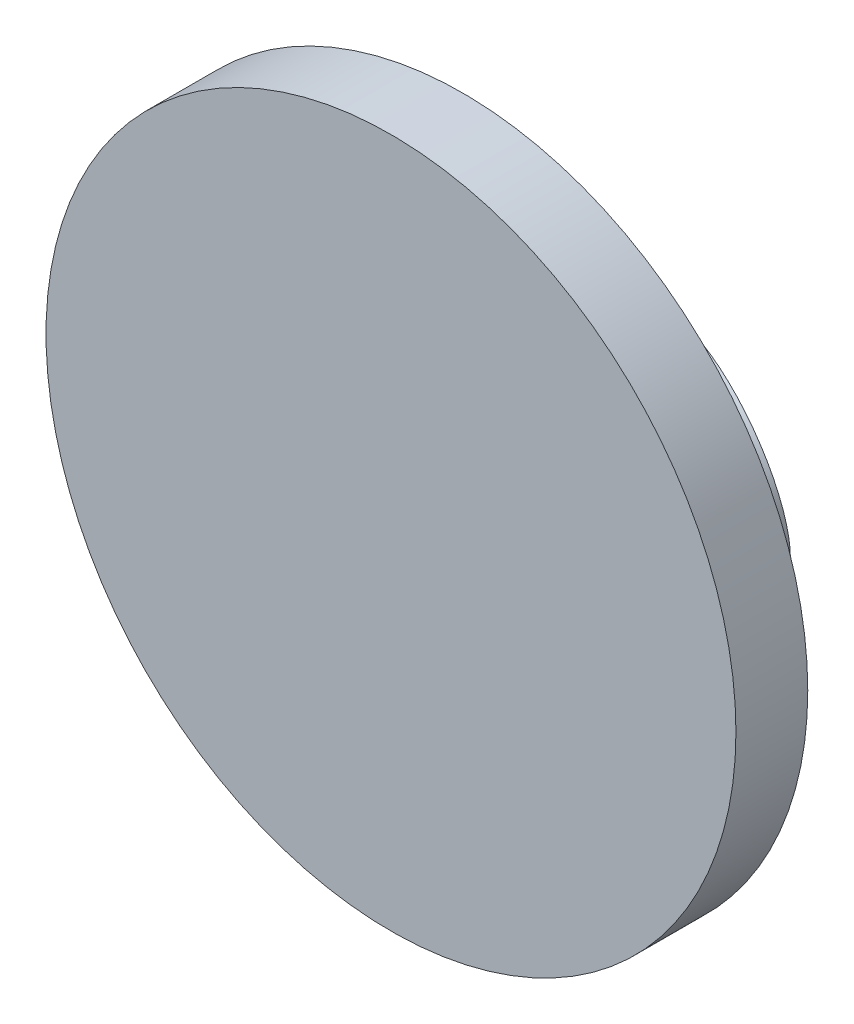
ISO-10303-21;
HEADER;
FILE_DESCRIPTION(('STEP AP214'),'2;1');
FILE_NAME('part.step','',(''),(''),'','','');
FILE_SCHEMA(('AUTOMOTIVE_DESIGN { 1 0 10303 214 1 1 1 1 }'));
ENDSEC;
DATA;
#1=APPLICATION_CONTEXT('core data for automotive mechanical design processes');
#2=APPLICATION_PROTOCOL_DEFINITION('international standard','automotive_design',2000,#1);
#3=PRODUCT_CONTEXT('',#1,'mechanical');
#4=PRODUCT('Part','Part','',(#3));
#5=PRODUCT_RELATED_PRODUCT_CATEGORY('part','',(#4));
#6=PRODUCT_DEFINITION_FORMATION('','',#4);
#7=PRODUCT_DEFINITION_CONTEXT('part definition',#1,'design');
#8=PRODUCT_DEFINITION('design','',#6,#7);
#9=PRODUCT_DEFINITION_SHAPE('','',#8);
#10=(LENGTH_UNIT() NAMED_UNIT(*) SI_UNIT(.MILLI.,.METRE.));
#11=(NAMED_UNIT(*) PLANE_ANGLE_UNIT() SI_UNIT($,.RADIAN.));
#12=(NAMED_UNIT(*) SI_UNIT($,.STERADIAN.) SOLID_ANGLE_UNIT());
#13=UNCERTAINTY_MEASURE_WITH_UNIT(LENGTH_MEASURE(1.E-05),#10,'distance_accuracy_value','');
#14=(GEOMETRIC_REPRESENTATION_CONTEXT(3) GLOBAL_UNCERTAINTY_ASSIGNED_CONTEXT((#13)) GLOBAL_UNIT_ASSIGNED_CONTEXT((#10,
#11,#12)) REPRESENTATION_CONTEXT('',''));
#15=CARTESIAN_POINT('',(0.,0.,0.));
#16=DIRECTION('',(0.,0.,1.));
#17=DIRECTION('',(1.,0.,0.));
#18=AXIS2_PLACEMENT_3D('',#15,#16,#17);
#19=CARTESIAN_POINT('',(0.,0.,8.85));
#20=DIRECTION('',(0.,0.,-1.));
#21=DIRECTION('',(-1.,0.,0.));
#22=AXIS2_PLACEMENT_3D('',#19,#20,#21);
#23=CYLINDRICAL_SURFACE('',#22,42.5);
#24=CARTESIAN_POINT('',(0.,0.,8.85));
#25=DIRECTION('',(0.,0.,1.));
#26=DIRECTION('',(1.,0.,0.));
#27=AXIS2_PLACEMENT_3D('',#24,#25,#26);
#28=CIRCLE('',#27,42.5);
#29=CARTESIAN_POINT('',(42.5,0.,8.85));
#30=VERTEX_POINT('',#29);
#31=EDGE_CURVE('E94',#30,#30,#28,.T.);
#32=ORIENTED_EDGE('',*,*,#31,.F.);
#33=EDGE_LOOP('',(#32));
#34=FACE_BOUND('',#33,.T.);
#35=CARTESIAN_POINT('',(0.,0.,0.));
#36=DIRECTION('',(0.,0.,1.));
#37=DIRECTION('',(1.,0.,0.));
#38=AXIS2_PLACEMENT_3D('',#35,#36,#37);
#39=CIRCLE('',#38,42.5);
#40=CARTESIAN_POINT('',(42.5,0.,0.));
#41=VERTEX_POINT('',#40);
#42=EDGE_CURVE('E92',#41,#41,#39,.T.);
#43=ORIENTED_EDGE('',*,*,#42,.T.);
#44=EDGE_LOOP('',(#43));
#45=FACE_BOUND('',#44,.T.);
#46=ADVANCED_FACE('F38',(#34,#45),#23,.T.);
#47=CARTESIAN_POINT('',(0.,0.,8.85));
#48=DIRECTION('',(0.,0.,1.));
#49=DIRECTION('',(1.,0.,0.));
#50=AXIS2_PLACEMENT_3D('',#47,#48,#49);
#51=PLANE('',#50);
#52=ORIENTED_EDGE('',*,*,#31,.T.);
#53=EDGE_LOOP('',(#52));
#54=FACE_BOUND('',#53,.T.);
#55=ADVANCED_FACE('F81',(#54),#51,.T.);
#56=CARTESIAN_POINT('',(0.,0.,0.));
#57=DIRECTION('',(0.,0.,1.));
#58=DIRECTION('',(1.,0.,0.));
#59=AXIS2_PLACEMENT_3D('',#56,#57,#58);
#60=PLANE('',#59);
#61=DIRECTION('',(0.499999999999998,-0.86602540378444,0.));
#62=VECTOR('',#61,1.);
#63=CARTESIAN_POINT('',(12.9998752538522,7.50548147724309,0.));
#64=LINE('',#63,#62);
#65=CARTESIAN_POINT('',(11.1632390619226,10.6866286766849,0.));
#66=VERTEX_POINT('',#65);
#67=CARTESIAN_POINT('',(14.836511445782,4.3243342778009,0.));
#68=VERTEX_POINT('',#67);
#69=EDGE_CURVE('E45',#66,#68,#64,.T.);
#70=ORIENTED_EDGE('',*,*,#69,.T.);
#71=CARTESIAN_POINT('',(24.6420272170539,14.2270810471439,0.));
#72=DIRECTION('',(0.,0.,1.));
#73=DIRECTION('',(-0.86602540378444,-0.499999999999998,0.));
#74=AXIS2_PLACEMENT_3D('',#71,#72,#73);
#75=ELLIPSE('',#74,14.,13.1556966910027);
#76=EDGE_CURVE('E11',#68,#66,#75,.T.);
#77=ORIENTED_EDGE('',*,*,#76,.T.);
#78=EDGE_LOOP('',(#70,#77));
#79=FACE_BOUND('',#78,.T.);
#80=DIRECTION('',(0.499999999999998,0.86602540378444,0.));
#81=VECTOR('',#80,1.);
#82=CARTESIAN_POINT('',(-12.9998752538522,7.50548147724309,0.));
#83=LINE('',#82,#81);
#84=CARTESIAN_POINT('',(-14.8365114457818,4.32433427780124,0.));
#85=VERTEX_POINT('',#84);
#86=CARTESIAN_POINT('',(-11.1632390619225,10.6866286766853,0.));
#87=VERTEX_POINT('',#86);
#88=EDGE_CURVE('E85',#85,#87,#83,.T.);
#89=ORIENTED_EDGE('',*,*,#88,.T.);
#90=CARTESIAN_POINT('',(-24.6420272170537,14.2270810471442,0.));
#91=DIRECTION('',(0.,0.,1.));
#92=DIRECTION('',(0.86602540378444,-0.499999999999998,0.));
#93=AXIS2_PLACEMENT_3D('',#90,#91,#92);
#94=ELLIPSE('',#93,14.,13.1556966910027);
#95=EDGE_CURVE('E72',#87,#85,#94,.T.);
#96=ORIENTED_EDGE('',*,*,#95,.T.);
#97=EDGE_LOOP('',(#89,#96));
#98=FACE_BOUND('',#97,.T.);
#99=DIRECTION('',(-1.,0.,0.));
#100=VECTOR('',#99,1.);
#101=CARTESIAN_POINT('',(1.04087506927604E-13,-15.0109629544862,0.));
#102=LINE('',#101,#100);
#103=CARTESIAN_POINT('',(3.67327238385925,-15.0109629544862,0.));
#104=VERTEX_POINT('',#103);
#105=CARTESIAN_POINT('',(-3.67327238385943,-15.0109629544863,0.));
#106=VERTEX_POINT('',#105);
#107=EDGE_CURVE('E89',#104,#106,#102,.T.);
#108=ORIENTED_EDGE('',*,*,#107,.T.);
#109=CARTESIAN_POINT('',(0.,-28.4541620942882,0.));
#110=DIRECTION('',(0.,0.,1.));
#111=DIRECTION('',(0.,1.,0.));
#112=AXIS2_PLACEMENT_3D('',#109,#110,#111);
#113=ELLIPSE('',#112,14.,13.1556966910027);
#114=EDGE_CURVE('E105',#106,#104,#113,.T.);
#115=ORIENTED_EDGE('',*,*,#114,.T.);
#116=EDGE_LOOP('',(#108,#115));
#117=FACE_BOUND('',#116,.T.);
#118=ORIENTED_EDGE('',*,*,#42,.F.);
#119=EDGE_LOOP('',(#118));
#120=FACE_BOUND('',#119,.T.);
#121=ADVANCED_FACE('F77',(#79,#98,#117,#120),#60,.F.);
#122=CARTESIAN_POINT('',(0.,-30.3018079570375,-5.07636528705226));
#123=DIRECTION('',(0.,0.342020143325676,0.939692620785906));
#124=DIRECTION('',(0.,-0.939692620785906,0.342020143325676));
#125=AXIS2_PLACEMENT_3D('',#122,#123,#124);
#126=CYLINDRICAL_SURFACE('',#125,13.1556966910027);
#127=CARTESIAN_POINT('',(0.,-30.3018079570375,-5.07636528705226));
#128=DIRECTION('',(0.,0.342020143325676,0.939692620785906));
#129=DIRECTION('',(0.,-0.939692620785906,0.342020143325676));
#130=AXIS2_PLACEMENT_3D('',#127,#128,#129);
#131=CIRCLE('',#130,13.1556966910027);
#132=CARTESIAN_POINT('',(0.,-42.6641190588702,-0.576852019246405));
#133=VERTEX_POINT('',#132);
#134=EDGE_CURVE('E95',#133,#133,#131,.T.);
#135=ORIENTED_EDGE('',*,*,#134,.T.);
#136=EDGE_LOOP('',(#135));
#137=FACE_BOUND('',#136,.T.);
#138=ORIENTED_EDGE('',*,*,#114,.F.);
#139=CARTESIAN_POINT('',(0.,-26.8816065237807,4.3205609208068));
#140=DIRECTION('',(0.,0.342020143325676,0.939692620785906));
#141=DIRECTION('',(0.,-0.939692620785906,0.342020143325676));
#142=AXIS2_PLACEMENT_3D('',#139,#140,#141);
#143=CIRCLE('',#142,13.1556966910027);
#144=EDGE_CURVE('E100',#104,#106,#143,.T.);
#145=ORIENTED_EDGE('',*,*,#144,.F.);
#146=EDGE_LOOP('',(#138,#145));
#147=FACE_BOUND('',#146,.T.);
#148=ADVANCED_FACE('F80',(#137,#147),#126,.T.);
#149=CARTESIAN_POINT('',(0.,-26.8816065237807,4.3205609208068));
#150=DIRECTION('',(0.,0.342020143325676,0.939692620785906));
#151=DIRECTION('',(0.,-0.939692620785906,0.342020143325676));
#152=AXIS2_PLACEMENT_3D('',#149,#150,#151);
#153=PLANE('',#152);
#154=ORIENTED_EDGE('',*,*,#107,.F.);
#155=ORIENTED_EDGE('',*,*,#144,.T.);
#156=EDGE_LOOP('',(#154,#155));
#157=FACE_BOUND('',#156,.T.);
#158=ADVANCED_FACE('F119',(#157),#153,.T.);
#159=CARTESIAN_POINT('',(0.,-30.3018079570375,-5.07636528705226));
#160=DIRECTION('',(0.,0.342020143325676,0.939692620785906));
#161=DIRECTION('',(0.,-0.939692620785906,0.342020143325676));
#162=AXIS2_PLACEMENT_3D('',#159,#160,#161);
#163=PLANE('',#162);
#164=ORIENTED_EDGE('',*,*,#134,.F.);
#165=EDGE_LOOP('',(#164));
#166=FACE_BOUND('',#165,.T.);
#167=ADVANCED_FACE('F127',(#166),#163,.F.);
#168=CARTESIAN_POINT('',(-26.2421354713918,15.1509039785188,-5.07636528705226));
#169=DIRECTION('',(0.29619813272603,-0.171010071662837,0.939692620785906));
#170=DIRECTION('',(0.953741925422945,0.,-0.300626578483229));
#171=AXIS2_PLACEMENT_3D('',#168,#169,#170);
#172=CYLINDRICAL_SURFACE('',#171,13.1556966910027);
#173=CARTESIAN_POINT('',(-26.2421354713918,15.1509039785188,-5.07636528705226));
#174=DIRECTION('',(0.29619813272603,-0.171010071662837,0.939692620785906));
#175=DIRECTION('',(-0.813797681349369,0.469846310392957,0.342020143325676));
#176=AXIS2_PLACEMENT_3D('',#173,#174,#175);
#177=CIRCLE('',#176,13.1556966910027);
#178=CARTESIAN_POINT('',(-36.9482109350654,21.3320595294353,-0.576852019246405));
#179=VERTEX_POINT('',#178);
#180=EDGE_CURVE('E110',#179,#179,#177,.T.);
#181=ORIENTED_EDGE('',*,*,#180,.T.);
#182=EDGE_LOOP('',(#181));
#183=FACE_BOUND('',#182,.T.);
#184=ORIENTED_EDGE('',*,*,#95,.F.);
#185=CARTESIAN_POINT('',(-23.2801541441315,13.4408032618905,4.3205609208068));
#186=DIRECTION('',(0.29619813272603,-0.171010071662837,0.939692620785906));
#187=DIRECTION('',(-0.813797681349369,0.469846310392957,0.342020143325676));
#188=AXIS2_PLACEMENT_3D('',#185,#186,#187);
#189=CIRCLE('',#188,13.1556966910027);
#190=EDGE_CURVE('E58',#85,#87,#189,.T.);
#191=ORIENTED_EDGE('',*,*,#190,.F.);
#192=EDGE_LOOP('',(#184,#191));
#193=FACE_BOUND('',#192,.T.);
#194=ADVANCED_FACE('F109',(#183,#193),#172,.T.);
#195=CARTESIAN_POINT('',(-23.2801541441315,13.4408032618905,4.3205609208068));
#196=DIRECTION('',(0.29619813272603,-0.171010071662837,0.939692620785906));
#197=DIRECTION('',(-0.813797681349369,0.469846310392957,0.342020143325676));
#198=AXIS2_PLACEMENT_3D('',#195,#196,#197);
#199=PLANE('',#198);
#200=ORIENTED_EDGE('',*,*,#88,.F.);
#201=ORIENTED_EDGE('',*,*,#190,.T.);
#202=EDGE_LOOP('',(#200,#201));
#203=FACE_BOUND('',#202,.T.);
#204=ADVANCED_FACE('F160',(#203),#199,.T.);
#205=CARTESIAN_POINT('',(-26.2421354713918,15.1509039785188,-5.07636528705226));
#206=DIRECTION('',(0.29619813272603,-0.171010071662837,0.939692620785906));
#207=DIRECTION('',(-0.813797681349369,0.469846310392957,0.342020143325676));
#208=AXIS2_PLACEMENT_3D('',#205,#206,#207);
#209=PLANE('',#208);
#210=ORIENTED_EDGE('',*,*,#180,.F.);
#211=EDGE_LOOP('',(#210));
#212=FACE_BOUND('',#211,.T.);
#213=ADVANCED_FACE('F173',(#212),#209,.F.);
#214=CARTESIAN_POINT('',(26.242135471392,15.1509039785185,-5.07636528705226));
#215=DIRECTION('',(-0.29619813272603,-0.171010071662837,0.939692620785906));
#216=DIRECTION('',(0.953741925422945,0.,0.300626578483229));
#217=AXIS2_PLACEMENT_3D('',#214,#215,#216);
#218=CYLINDRICAL_SURFACE('',#217,13.1556966910027);
#219=CARTESIAN_POINT('',(26.242135471392,15.1509039785185,-5.07636528705226));
#220=DIRECTION('',(-0.29619813272603,-0.171010071662837,0.939692620785906));
#221=DIRECTION('',(0.813797681349376,0.469846310392945,0.342020143325676));
#222=AXIS2_PLACEMENT_3D('',#219,#220,#221);
#223=CIRCLE('',#222,13.1556966910027);
#224=CARTESIAN_POINT('',(36.9482109350657,21.3320595294348,-0.576852019246405));
#225=VERTEX_POINT('',#224);
#226=EDGE_CURVE('E75',#225,#225,#223,.T.);
#227=ORIENTED_EDGE('',*,*,#226,.T.);
#228=EDGE_LOOP('',(#227));
#229=FACE_BOUND('',#228,.T.);
#230=ORIENTED_EDGE('',*,*,#76,.F.);
#231=CARTESIAN_POINT('',(23.2801541441317,13.4408032618901,4.3205609208068));
#232=DIRECTION('',(-0.29619813272603,-0.171010071662837,0.939692620785906));
#233=DIRECTION('',(0.813797681349376,0.469846310392945,0.342020143325676));
#234=AXIS2_PLACEMENT_3D('',#231,#232,#233);
#235=CIRCLE('',#234,13.1556966910027);
#236=EDGE_CURVE('E51',#66,#68,#235,.T.);
#237=ORIENTED_EDGE('',*,*,#236,.F.);
#238=EDGE_LOOP('',(#230,#237));
#239=FACE_BOUND('',#238,.T.);
#240=ADVANCED_FACE('F74',(#229,#239),#218,.T.);
#241=CARTESIAN_POINT('',(23.2801541441317,13.4408032618901,4.3205609208068));
#242=DIRECTION('',(-0.29619813272603,-0.171010071662837,0.939692620785906));
#243=DIRECTION('',(0.813797681349376,0.469846310392945,0.342020143325676));
#244=AXIS2_PLACEMENT_3D('',#241,#242,#243);
#245=PLANE('',#244);
#246=ORIENTED_EDGE('',*,*,#69,.F.);
#247=ORIENTED_EDGE('',*,*,#236,.T.);
#248=EDGE_LOOP('',(#246,#247));
#249=FACE_BOUND('',#248,.T.);
#250=ADVANCED_FACE('F70',(#249),#245,.T.);
#251=CARTESIAN_POINT('',(26.242135471392,15.1509039785185,-5.07636528705226));
#252=DIRECTION('',(-0.29619813272603,-0.171010071662837,0.939692620785906));
#253=DIRECTION('',(0.813797681349376,0.469846310392945,0.342020143325676));
#254=AXIS2_PLACEMENT_3D('',#251,#252,#253);
#255=PLANE('',#254);
#256=ORIENTED_EDGE('',*,*,#226,.F.);
#257=EDGE_LOOP('',(#256));
#258=FACE_BOUND('',#257,.T.);
#259=ADVANCED_FACE('F203',(#258),#255,.F.);
#260=CLOSED_SHELL('',(#46,#55,#121,#148,#158,#167,#194,#204,#213,#240,#250,#259));
#261=MANIFOLD_SOLID_BREP('B2',#260);
#262=ADVANCED_BREP_SHAPE_REPRESENTATION('',(#18,#261),#14);
#263=SHAPE_DEFINITION_REPRESENTATION(#9,#262);
ENDSEC;
END-ISO-10303-21;
